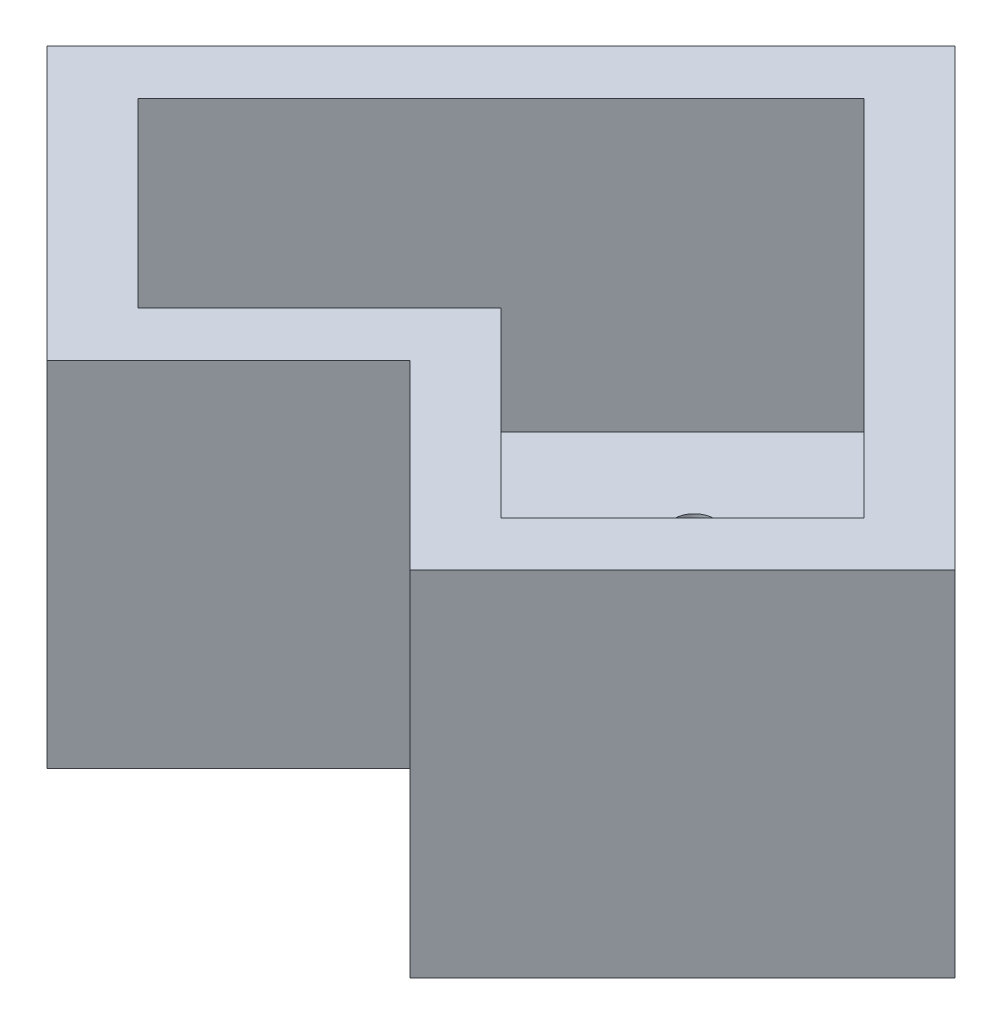
ISO-10303-21;
HEADER;
FILE_DESCRIPTION(('STEP AP214'),'2;1');
FILE_NAME('part.step','',(''),(''),'','','');
FILE_SCHEMA(('AUTOMOTIVE_DESIGN { 1 0 10303 214 1 1 1 1 }'));
ENDSEC;
DATA;
#1=APPLICATION_CONTEXT('core data for automotive mechanical design processes');
#2=APPLICATION_PROTOCOL_DEFINITION('international standard','automotive_design',2000,#1);
#3=PRODUCT_CONTEXT('',#1,'mechanical');
#4=PRODUCT('Part','Part','',(#3));
#5=PRODUCT_RELATED_PRODUCT_CATEGORY('part','',(#4));
#6=PRODUCT_DEFINITION_FORMATION('','',#4);
#7=PRODUCT_DEFINITION_CONTEXT('part definition',#1,'design');
#8=PRODUCT_DEFINITION('design','',#6,#7);
#9=PRODUCT_DEFINITION_SHAPE('','',#8);
#10=(LENGTH_UNIT() NAMED_UNIT(*) SI_UNIT(.MILLI.,.METRE.));
#11=(NAMED_UNIT(*) PLANE_ANGLE_UNIT() SI_UNIT($,.RADIAN.));
#12=(NAMED_UNIT(*) SI_UNIT($,.STERADIAN.) SOLID_ANGLE_UNIT());
#13=UNCERTAINTY_MEASURE_WITH_UNIT(LENGTH_MEASURE(1.E-05),#10,'distance_accuracy_value','');
#14=(GEOMETRIC_REPRESENTATION_CONTEXT(3) GLOBAL_UNCERTAINTY_ASSIGNED_CONTEXT((#13)) GLOBAL_UNIT_ASSIGNED_CONTEXT((#10,
#11,#12)) REPRESENTATION_CONTEXT('',''));
#15=CARTESIAN_POINT('',(0.,0.,0.));
#16=DIRECTION('',(0.,0.,1.));
#17=DIRECTION('',(1.,0.,0.));
#18=AXIS2_PLACEMENT_3D('',#15,#16,#17);
#19=CARTESIAN_POINT('',(0.,11.,0.));
#20=DIRECTION('',(0.,-1.,0.));
#21=DIRECTION('',(0.,0.,-1.));
#22=AXIS2_PLACEMENT_3D('',#19,#20,#21);
#23=PLANE('',#22);
#24=DIRECTION('',(0.707106781186548,0.,-0.707106781186547));
#25=VECTOR('',#24,1.);
#26=CARTESIAN_POINT('',(-5.65685424949238,11.,5.65685424949238));
#27=LINE('',#26,#25);
#28=CARTESIAN_POINT('',(-5.65685424949238,11.,5.65685424949238));
#29=VERTEX_POINT('',#28);
#30=CARTESIAN_POINT('',(0.,11.,0.));
#31=VERTEX_POINT('',#30);
#32=EDGE_CURVE('E147',#29,#31,#27,.T.);
#33=ORIENTED_EDGE('',*,*,#32,.T.);
#34=DIRECTION('',(0.707106781186548,0.,0.707106781186547));
#35=VECTOR('',#34,1.);
#36=CARTESIAN_POINT('',(0.,11.,0.));
#37=LINE('',#36,#35);
#38=CARTESIAN_POINT('',(5.65685424949238,11.,5.65685424949238));
#39=VERTEX_POINT('',#38);
#40=EDGE_CURVE('E98',#31,#39,#37,.T.);
#41=ORIENTED_EDGE('',*,*,#40,.T.);
#42=DIRECTION('',(0.707106781186548,0.,-0.707106781186547));
#43=VECTOR('',#42,1.);
#44=CARTESIAN_POINT('',(5.65685424949238,11.,5.65685424949238));
#45=LINE('',#44,#43);
#46=CARTESIAN_POINT('',(14.142135623731,11.,-2.82842712474619));
#47=VERTEX_POINT('',#46);
#48=EDGE_CURVE('E114',#39,#47,#45,.T.);
#49=ORIENTED_EDGE('',*,*,#48,.T.);
#50=DIRECTION('',(-0.707106781186548,0.,-0.707106781186547));
#51=VECTOR('',#50,1.);
#52=CARTESIAN_POINT('',(14.142135623731,11.,-2.82842712474619));
#53=LINE('',#52,#51);
#54=CARTESIAN_POINT('',(0.,11.,-16.9705627484771));
#55=VERTEX_POINT('',#54);
#56=EDGE_CURVE('E107',#47,#55,#53,.T.);
#57=ORIENTED_EDGE('',*,*,#56,.T.);
#58=DIRECTION('',(-0.707106781186548,0.,0.707106781186547));
#59=VECTOR('',#58,1.);
#60=CARTESIAN_POINT('',(0.,11.,-16.9705627484771));
#61=LINE('',#60,#59);
#62=CARTESIAN_POINT('',(-14.1421356237309,11.,-2.82842712474619));
#63=VERTEX_POINT('',#62);
#64=EDGE_CURVE('E111',#55,#63,#61,.T.);
#65=ORIENTED_EDGE('',*,*,#64,.T.);
#66=DIRECTION('',(0.707106781186548,0.,0.707106781186547));
#67=VECTOR('',#66,1.);
#68=CARTESIAN_POINT('',(-14.1421356237309,11.,-2.82842712474619));
#69=LINE('',#68,#67);
#70=EDGE_CURVE('E63',#63,#29,#69,.T.);
#71=ORIENTED_EDGE('',*,*,#70,.T.);
#72=EDGE_LOOP('',(#33,#41,#49,#57,#65,#71));
#73=FACE_BOUND('',#72,.T.);
#74=DIRECTION('',(0.707106781186548,0.,-0.707106781186547));
#75=VECTOR('',#74,1.);
#76=CARTESIAN_POINT('',(-1.4142135623731,11.,-1.4142135623731));
#77=LINE('',#76,#75);
#78=CARTESIAN_POINT('',(-5.65685424949238,11.,2.82842712474618));
#79=VERTEX_POINT('',#78);
#80=CARTESIAN_POINT('',(0.,11.,-2.82842712474619));
#81=VERTEX_POINT('',#80);
#82=EDGE_CURVE('E212',#79,#81,#77,.T.);
#83=ORIENTED_EDGE('',*,*,#82,.F.);
#84=DIRECTION('',(0.707106781186548,0.,0.707106781186547));
#85=VECTOR('',#84,1.);
#86=CARTESIAN_POINT('',(-4.24264068711928,11.,4.24264068711928));
#87=LINE('',#86,#85);
#88=CARTESIAN_POINT('',(-11.3137084989848,11.,-2.82842712474619));
#89=VERTEX_POINT('',#88);
#90=EDGE_CURVE('E191',#89,#79,#87,.T.);
#91=ORIENTED_EDGE('',*,*,#90,.F.);
#92=DIRECTION('',(-0.707106781186548,0.,0.707106781186547));
#93=VECTOR('',#92,1.);
#94=CARTESIAN_POINT('',(-7.07106781186547,11.,-7.07106781186548));
#95=LINE('',#94,#93);
#96=CARTESIAN_POINT('',(0.,11.,-14.1421356237309));
#97=VERTEX_POINT('',#96);
#98=EDGE_CURVE('E224',#97,#89,#95,.T.);
#99=ORIENTED_EDGE('',*,*,#98,.F.);
#100=DIRECTION('',(-0.707106781186548,0.,-0.707106781186547));
#101=VECTOR('',#100,1.);
#102=CARTESIAN_POINT('',(7.07106781186548,11.,-7.07106781186548));
#103=LINE('',#102,#101);
#104=CARTESIAN_POINT('',(11.3137084989848,11.,-2.82842712474619));
#105=VERTEX_POINT('',#104);
#106=EDGE_CURVE('E221',#105,#97,#103,.T.);
#107=ORIENTED_EDGE('',*,*,#106,.F.);
#108=DIRECTION('',(0.707106781186548,0.,-0.707106781186547));
#109=VECTOR('',#108,1.);
#110=CARTESIAN_POINT('',(4.24264068711928,11.,4.24264068711929));
#111=LINE('',#110,#109);
#112=CARTESIAN_POINT('',(5.65685424949238,11.,2.82842712474619));
#113=VERTEX_POINT('',#112);
#114=EDGE_CURVE('E218',#113,#105,#111,.T.);
#115=ORIENTED_EDGE('',*,*,#114,.F.);
#116=DIRECTION('',(0.707106781186548,0.,0.707106781186547));
#117=VECTOR('',#116,1.);
#118=CARTESIAN_POINT('',(1.41421356237309,11.,-1.4142135623731));
#119=LINE('',#118,#117);
#120=EDGE_CURVE('E215',#81,#113,#119,.T.);
#121=ORIENTED_EDGE('',*,*,#120,.F.);
#122=EDGE_LOOP('',(#83,#91,#99,#107,#115,#121));
#123=FACE_BOUND('',#122,.T.);
#124=ADVANCED_FACE('F37',(#73,#123),#23,.F.);
#125=CARTESIAN_POINT('',(-5.65685424949238,11.,5.65685424949238));
#126=DIRECTION('',(-0.707106781186547,0.,-0.707106781186548));
#127=DIRECTION('',(-0.707106781186548,0.,0.707106781186547));
#128=AXIS2_PLACEMENT_3D('',#125,#126,#127);
#129=PLANE('',#128);
#130=DIRECTION('',(0.707106781186548,0.,-0.707106781186547));
#131=VECTOR('',#130,1.);
#132=CARTESIAN_POINT('',(-5.65685424949238,0.,5.65685424949238));
#133=LINE('',#132,#131);
#134=CARTESIAN_POINT('',(-5.65685424949238,0.,5.65685424949238));
#135=VERTEX_POINT('',#134);
#136=CARTESIAN_POINT('',(0.,0.,0.));
#137=VERTEX_POINT('',#136);
#138=EDGE_CURVE('E135',#135,#137,#133,.T.);
#139=ORIENTED_EDGE('',*,*,#138,.T.);
#140=DIRECTION('',(0.,-1.,0.));
#141=VECTOR('',#140,1.);
#142=CARTESIAN_POINT('',(0.,11.,0.));
#143=LINE('',#142,#141);
#144=EDGE_CURVE('E11',#31,#137,#143,.T.);
#145=ORIENTED_EDGE('',*,*,#144,.F.);
#146=ORIENTED_EDGE('',*,*,#32,.F.);
#147=DIRECTION('',(0.,-1.,0.));
#148=VECTOR('',#147,1.);
#149=CARTESIAN_POINT('',(-5.65685424949238,11.,5.65685424949238));
#150=LINE('',#149,#148);
#151=EDGE_CURVE('E131',#29,#135,#150,.T.);
#152=ORIENTED_EDGE('',*,*,#151,.T.);
#153=EDGE_LOOP('',(#139,#145,#146,#152));
#154=FACE_BOUND('',#153,.T.);
#155=ADVANCED_FACE('F39',(#154),#129,.F.);
#156=CARTESIAN_POINT('',(0.,11.,0.));
#157=DIRECTION('',(0.707106781186547,0.,-0.707106781186548));
#158=DIRECTION('',(-0.707106781186548,0.,-0.707106781186547));
#159=AXIS2_PLACEMENT_3D('',#156,#157,#158);
#160=PLANE('',#159);
#161=DIRECTION('',(0.707106781186548,0.,0.707106781186547));
#162=VECTOR('',#161,1.);
#163=CARTESIAN_POINT('',(0.,0.,0.));
#164=LINE('',#163,#162);
#165=CARTESIAN_POINT('',(5.65685424949238,0.,5.65685424949238));
#166=VERTEX_POINT('',#165);
#167=EDGE_CURVE('E138',#137,#166,#164,.T.);
#168=ORIENTED_EDGE('',*,*,#167,.T.);
#169=DIRECTION('',(0.,-1.,0.));
#170=VECTOR('',#169,1.);
#171=CARTESIAN_POINT('',(5.65685424949238,11.,5.65685424949238));
#172=LINE('',#171,#170);
#173=EDGE_CURVE('E46',#39,#166,#172,.T.);
#174=ORIENTED_EDGE('',*,*,#173,.F.);
#175=ORIENTED_EDGE('',*,*,#40,.F.);
#176=ORIENTED_EDGE('',*,*,#144,.T.);
#177=EDGE_LOOP('',(#168,#174,#175,#176));
#178=FACE_BOUND('',#177,.T.);
#179=ADVANCED_FACE('F230',(#178),#160,.F.);
#180=CARTESIAN_POINT('',(5.65685424949238,11.,5.65685424949238));
#181=DIRECTION('',(-0.707106781186547,0.,-0.707106781186548));
#182=DIRECTION('',(-0.707106781186548,0.,0.707106781186547));
#183=AXIS2_PLACEMENT_3D('',#180,#181,#182);
#184=PLANE('',#183);
#185=DIRECTION('',(0.707106781186548,0.,-0.707106781186547));
#186=VECTOR('',#185,1.);
#187=CARTESIAN_POINT('',(5.65685424949238,0.,5.65685424949238));
#188=LINE('',#187,#186);
#189=CARTESIAN_POINT('',(14.142135623731,0.,-2.82842712474619));
#190=VERTEX_POINT('',#189);
#191=EDGE_CURVE('E141',#166,#190,#188,.T.);
#192=ORIENTED_EDGE('',*,*,#191,.T.);
#193=DIRECTION('',(0.,-1.,0.));
#194=VECTOR('',#193,1.);
#195=CARTESIAN_POINT('',(14.142135623731,11.,-2.82842712474619));
#196=LINE('',#195,#194);
#197=EDGE_CURVE('E126',#47,#190,#196,.T.);
#198=ORIENTED_EDGE('',*,*,#197,.F.);
#199=ORIENTED_EDGE('',*,*,#48,.F.);
#200=ORIENTED_EDGE('',*,*,#173,.T.);
#201=EDGE_LOOP('',(#192,#198,#199,#200));
#202=FACE_BOUND('',#201,.T.);
#203=ADVANCED_FACE('F233',(#202),#184,.F.);
#204=CARTESIAN_POINT('',(14.142135623731,11.,-2.82842712474619));
#205=DIRECTION('',(-0.707106781186547,0.,0.707106781186548));
#206=DIRECTION('',(0.707106781186548,0.,0.707106781186547));
#207=AXIS2_PLACEMENT_3D('',#204,#205,#206);
#208=PLANE('',#207);
#209=DIRECTION('',(-0.707106781186548,0.,-0.707106781186547));
#210=VECTOR('',#209,1.);
#211=CARTESIAN_POINT('',(14.142135623731,0.,-2.82842712474619));
#212=LINE('',#211,#210);
#213=CARTESIAN_POINT('',(0.,0.,-16.9705627484771));
#214=VERTEX_POINT('',#213);
#215=EDGE_CURVE('E123',#190,#214,#212,.T.);
#216=ORIENTED_EDGE('',*,*,#215,.T.);
#217=DIRECTION('',(0.,-1.,0.));
#218=VECTOR('',#217,1.);
#219=CARTESIAN_POINT('',(0.,11.,-16.9705627484771));
#220=LINE('',#219,#218);
#221=EDGE_CURVE('E120',#55,#214,#220,.T.);
#222=ORIENTED_EDGE('',*,*,#221,.F.);
#223=ORIENTED_EDGE('',*,*,#56,.F.);
#224=ORIENTED_EDGE('',*,*,#197,.T.);
#225=EDGE_LOOP('',(#216,#222,#223,#224));
#226=FACE_BOUND('',#225,.T.);
#227=ADVANCED_FACE('F121',(#226),#208,.F.);
#228=CARTESIAN_POINT('',(0.,11.,-16.9705627484771));
#229=DIRECTION('',(0.707106781186547,0.,0.707106781186548));
#230=DIRECTION('',(0.707106781186548,0.,-0.707106781186547));
#231=AXIS2_PLACEMENT_3D('',#228,#229,#230);
#232=PLANE('',#231);
#233=DIRECTION('',(-0.707106781186548,0.,0.707106781186547));
#234=VECTOR('',#233,1.);
#235=CARTESIAN_POINT('',(0.,0.,-16.9705627484771));
#236=LINE('',#235,#234);
#237=CARTESIAN_POINT('',(-14.1421356237309,0.,-2.82842712474619));
#238=VERTEX_POINT('',#237);
#239=EDGE_CURVE('E144',#214,#238,#236,.T.);
#240=ORIENTED_EDGE('',*,*,#239,.T.);
#241=DIRECTION('',(0.,-1.,0.));
#242=VECTOR('',#241,1.);
#243=CARTESIAN_POINT('',(-14.1421356237309,11.,-2.82842712474619));
#244=LINE('',#243,#242);
#245=EDGE_CURVE('E127',#63,#238,#244,.T.);
#246=ORIENTED_EDGE('',*,*,#245,.F.);
#247=ORIENTED_EDGE('',*,*,#64,.F.);
#248=ORIENTED_EDGE('',*,*,#221,.T.);
#249=EDGE_LOOP('',(#240,#246,#247,#248));
#250=FACE_BOUND('',#249,.T.);
#251=ADVANCED_FACE('F129',(#250),#232,.F.);
#252=CARTESIAN_POINT('',(-14.1421356237309,11.,-2.82842712474619));
#253=DIRECTION('',(0.707106781186547,0.,-0.707106781186548));
#254=DIRECTION('',(-0.707106781186548,0.,-0.707106781186547));
#255=AXIS2_PLACEMENT_3D('',#252,#253,#254);
#256=PLANE('',#255);
#257=DIRECTION('',(0.707106781186548,0.,0.707106781186547));
#258=VECTOR('',#257,1.);
#259=CARTESIAN_POINT('',(-14.1421356237309,0.,-2.82842712474619));
#260=LINE('',#259,#258);
#261=EDGE_CURVE('E90',#238,#135,#260,.T.);
#262=ORIENTED_EDGE('',*,*,#261,.T.);
#263=ORIENTED_EDGE('',*,*,#151,.F.);
#264=ORIENTED_EDGE('',*,*,#70,.F.);
#265=ORIENTED_EDGE('',*,*,#245,.T.);
#266=EDGE_LOOP('',(#262,#263,#264,#265));
#267=FACE_BOUND('',#266,.T.);
#268=ADVANCED_FACE('F237',(#267),#256,.F.);
#269=CARTESIAN_POINT('',(0.,0.,0.));
#270=DIRECTION('',(0.,-1.,0.));
#271=DIRECTION('',(0.,0.,-1.));
#272=AXIS2_PLACEMENT_3D('',#269,#270,#271);
#273=PLANE('',#272);
#274=CARTESIAN_POINT('',(5.65685424949238,0.,-1.55842712474619));
#275=DIRECTION('',(0.,-1.,0.));
#276=DIRECTION('',(0.,0.,-1.));
#277=AXIS2_PLACEMENT_3D('',#274,#275,#276);
#278=CIRCLE('',#277,0.625);
#279=CARTESIAN_POINT('',(5.65685424949238,0.,-2.18342712474619));
#280=VERTEX_POINT('',#279);
#281=EDGE_CURVE('E475',#280,#280,#278,.T.);
#282=ORIENTED_EDGE('',*,*,#281,.F.);
#283=EDGE_LOOP('',(#282));
#284=FACE_BOUND('',#283,.T.);
#285=CARTESIAN_POINT('',(0.,0.,-8.84842712474619));
#286=DIRECTION('',(0.,-1.,0.));
#287=DIRECTION('',(0.,0.,-1.));
#288=AXIS2_PLACEMENT_3D('',#285,#286,#287);
#289=CIRCLE('',#288,0.625);
#290=CARTESIAN_POINT('',(0.,0.,-9.47342712474619));
#291=VERTEX_POINT('',#290);
#292=EDGE_CURVE('E476',#291,#291,#289,.T.);
#293=ORIENTED_EDGE('',*,*,#292,.F.);
#294=EDGE_LOOP('',(#293));
#295=FACE_BOUND('',#294,.T.);
#296=CARTESIAN_POINT('',(0.,0.,-6.30842712474619));
#297=DIRECTION('',(0.,-1.,0.));
#298=DIRECTION('',(0.,0.,-1.));
#299=AXIS2_PLACEMENT_3D('',#296,#297,#298);
#300=CIRCLE('',#299,0.625);
#301=CARTESIAN_POINT('',(0.,0.,-6.93342712474619));
#302=VERTEX_POINT('',#301);
#303=EDGE_CURVE('E480',#302,#302,#300,.T.);
#304=ORIENTED_EDGE('',*,*,#303,.F.);
#305=EDGE_LOOP('',(#304));
#306=FACE_BOUND('',#305,.T.);
#307=CARTESIAN_POINT('',(-5.65685424949238,0.,-4.09842712474619));
#308=DIRECTION('',(0.,-1.,0.));
#309=DIRECTION('',(0.,0.,-1.));
#310=AXIS2_PLACEMENT_3D('',#307,#308,#309);
#311=CIRCLE('',#310,0.625);
#312=CARTESIAN_POINT('',(-5.65685424949238,0.,-4.72342712474619));
#313=VERTEX_POINT('',#312);
#314=EDGE_CURVE('E485',#313,#313,#311,.T.);
#315=ORIENTED_EDGE('',*,*,#314,.F.);
#316=EDGE_LOOP('',(#315));
#317=FACE_BOUND('',#316,.T.);
#318=CARTESIAN_POINT('',(5.65685424949238,0.,-4.09842712474619));
#319=DIRECTION('',(0.,-1.,0.));
#320=DIRECTION('',(0.,0.,-1.));
#321=AXIS2_PLACEMENT_3D('',#318,#319,#320);
#322=CIRCLE('',#321,0.625);
#323=CARTESIAN_POINT('',(5.65685424949238,0.,-4.72342712474619));
#324=VERTEX_POINT('',#323);
#325=EDGE_CURVE('E477',#324,#324,#322,.T.);
#326=ORIENTED_EDGE('',*,*,#325,.F.);
#327=EDGE_LOOP('',(#326));
#328=FACE_BOUND('',#327,.T.);
#329=CARTESIAN_POINT('',(-5.65685424949238,0.,-1.55842712474619));
#330=DIRECTION('',(0.,-1.,0.));
#331=DIRECTION('',(0.,0.,-1.));
#332=AXIS2_PLACEMENT_3D('',#329,#330,#331);
#333=CIRCLE('',#332,0.625);
#334=CARTESIAN_POINT('',(-5.65685424949238,0.,-2.18342712474619));
#335=VERTEX_POINT('',#334);
#336=EDGE_CURVE('E157',#335,#335,#333,.T.);
#337=ORIENTED_EDGE('',*,*,#336,.F.);
#338=EDGE_LOOP('',(#337));
#339=FACE_BOUND('',#338,.T.);
#340=ORIENTED_EDGE('',*,*,#138,.F.);
#341=ORIENTED_EDGE('',*,*,#261,.F.);
#342=ORIENTED_EDGE('',*,*,#239,.F.);
#343=ORIENTED_EDGE('',*,*,#215,.F.);
#344=ORIENTED_EDGE('',*,*,#191,.F.);
#345=ORIENTED_EDGE('',*,*,#167,.F.);
#346=EDGE_LOOP('',(#340,#341,#342,#343,#344,#345));
#347=FACE_BOUND('',#346,.T.);
#348=ADVANCED_FACE('F236',(#284,#295,#306,#317,#328,#339,#347),#273,.T.);
#349=CARTESIAN_POINT('',(-7.07106781186547,11.,4.24264068711928));
#350=DIRECTION('',(-0.707106781186547,0.,-0.707106781186548));
#351=DIRECTION('',(-0.707106781186548,0.,0.707106781186547));
#352=AXIS2_PLACEMENT_3D('',#349,#350,#351);
#353=PLANE('',#352);
#354=DIRECTION('',(0.707106781186548,0.,-0.707106781186547));
#355=VECTOR('',#354,1.);
#356=CARTESIAN_POINT('',(-1.4142135623731,2.,-1.4142135623731));
#357=LINE('',#356,#355);
#358=CARTESIAN_POINT('',(-5.65685424949238,2.,2.82842712474618));
#359=VERTEX_POINT('',#358);
#360=CARTESIAN_POINT('',(0.,2.,-2.82842712474619));
#361=VERTEX_POINT('',#360);
#362=EDGE_CURVE('E170',#359,#361,#357,.T.);
#363=ORIENTED_EDGE('',*,*,#362,.F.);
#364=DIRECTION('',(0.,-1.,0.));
#365=VECTOR('',#364,1.);
#366=CARTESIAN_POINT('',(-5.65685424949238,11.,2.82842712474619));
#367=LINE('',#366,#365);
#368=EDGE_CURVE('E189',#79,#359,#367,.T.);
#369=ORIENTED_EDGE('',*,*,#368,.F.);
#370=ORIENTED_EDGE('',*,*,#82,.T.);
#371=DIRECTION('',(0.,-1.,0.));
#372=VECTOR('',#371,1.);
#373=CARTESIAN_POINT('',(0.,11.,-2.82842712474619));
#374=LINE('',#373,#372);
#375=EDGE_CURVE('E139',#81,#361,#374,.T.);
#376=ORIENTED_EDGE('',*,*,#375,.T.);
#377=EDGE_LOOP('',(#363,#369,#370,#376));
#378=FACE_BOUND('',#377,.T.);
#379=ADVANCED_FACE('F253',(#378),#353,.T.);
#380=CARTESIAN_POINT('',(1.41421356237309,11.,-1.4142135623731));
#381=DIRECTION('',(0.707106781186547,0.,-0.707106781186548));
#382=DIRECTION('',(-0.707106781186548,0.,-0.707106781186547));
#383=AXIS2_PLACEMENT_3D('',#380,#381,#382);
#384=PLANE('',#383);
#385=DIRECTION('',(0.707106781186548,0.,0.707106781186547));
#386=VECTOR('',#385,1.);
#387=CARTESIAN_POINT('',(1.41421356237309,2.,-1.4142135623731));
#388=LINE('',#387,#386);
#389=CARTESIAN_POINT('',(5.65685424949238,2.,2.82842712474619));
#390=VERTEX_POINT('',#389);
#391=EDGE_CURVE('E174',#361,#390,#388,.T.);
#392=ORIENTED_EDGE('',*,*,#391,.F.);
#393=ORIENTED_EDGE('',*,*,#375,.F.);
#394=ORIENTED_EDGE('',*,*,#120,.T.);
#395=DIRECTION('',(0.,-1.,0.));
#396=VECTOR('',#395,1.);
#397=CARTESIAN_POINT('',(5.65685424949238,11.,2.82842712474619));
#398=LINE('',#397,#396);
#399=EDGE_CURVE('E188',#113,#390,#398,.T.);
#400=ORIENTED_EDGE('',*,*,#399,.T.);
#401=EDGE_LOOP('',(#392,#393,#394,#400));
#402=FACE_BOUND('',#401,.T.);
#403=ADVANCED_FACE('F294',(#402),#384,.T.);
#404=CARTESIAN_POINT('',(4.24264068711929,11.,4.24264068711928));
#405=DIRECTION('',(-0.707106781186547,0.,-0.707106781186548));
#406=DIRECTION('',(-0.707106781186548,0.,0.707106781186547));
#407=AXIS2_PLACEMENT_3D('',#404,#405,#406);
#408=PLANE('',#407);
#409=DIRECTION('',(0.707106781186548,0.,-0.707106781186547));
#410=VECTOR('',#409,1.);
#411=CARTESIAN_POINT('',(4.24264068711928,2.,4.24264068711929));
#412=LINE('',#411,#410);
#413=CARTESIAN_POINT('',(11.3137084989848,2.,-2.82842712474619));
#414=VERTEX_POINT('',#413);
#415=EDGE_CURVE('E181',#390,#414,#412,.T.);
#416=ORIENTED_EDGE('',*,*,#415,.F.);
#417=ORIENTED_EDGE('',*,*,#399,.F.);
#418=ORIENTED_EDGE('',*,*,#114,.T.);
#419=DIRECTION('',(0.,-1.,0.));
#420=VECTOR('',#419,1.);
#421=CARTESIAN_POINT('',(11.3137084989848,11.,-2.82842712474619));
#422=LINE('',#421,#420);
#423=EDGE_CURVE('E195',#105,#414,#422,.T.);
#424=ORIENTED_EDGE('',*,*,#423,.T.);
#425=EDGE_LOOP('',(#416,#417,#418,#424));
#426=FACE_BOUND('',#425,.T.);
#427=ADVANCED_FACE('F302',(#426),#408,.T.);
#428=CARTESIAN_POINT('',(12.7279220613579,11.,-1.4142135623731));
#429=DIRECTION('',(-0.707106781186547,0.,0.707106781186548));
#430=DIRECTION('',(0.707106781186548,0.,0.707106781186547));
#431=AXIS2_PLACEMENT_3D('',#428,#429,#430);
#432=PLANE('',#431);
#433=DIRECTION('',(-0.707106781186548,0.,-0.707106781186547));
#434=VECTOR('',#433,1.);
#435=CARTESIAN_POINT('',(7.07106781186548,2.,-7.07106781186548));
#436=LINE('',#435,#434);
#437=CARTESIAN_POINT('',(0.,2.,-14.1421356237309));
#438=VERTEX_POINT('',#437);
#439=EDGE_CURVE('E198',#414,#438,#436,.T.);
#440=ORIENTED_EDGE('',*,*,#439,.F.);
#441=ORIENTED_EDGE('',*,*,#423,.F.);
#442=ORIENTED_EDGE('',*,*,#106,.T.);
#443=DIRECTION('',(0.,-1.,0.));
#444=VECTOR('',#443,1.);
#445=CARTESIAN_POINT('',(0.,11.,-14.1421356237309));
#446=LINE('',#445,#444);
#447=EDGE_CURVE('E201',#97,#438,#446,.T.);
#448=ORIENTED_EDGE('',*,*,#447,.T.);
#449=EDGE_LOOP('',(#440,#441,#442,#448));
#450=FACE_BOUND('',#449,.T.);
#451=ADVANCED_FACE('F310',(#450),#432,.T.);
#452=CARTESIAN_POINT('',(1.41421356237309,11.,-15.556349186104));
#453=DIRECTION('',(0.707106781186547,0.,0.707106781186548));
#454=DIRECTION('',(0.707106781186548,0.,-0.707106781186547));
#455=AXIS2_PLACEMENT_3D('',#452,#453,#454);
#456=PLANE('',#455);
#457=DIRECTION('',(-0.707106781186548,0.,0.707106781186547));
#458=VECTOR('',#457,1.);
#459=CARTESIAN_POINT('',(-7.07106781186547,2.,-7.07106781186548));
#460=LINE('',#459,#458);
#461=CARTESIAN_POINT('',(-11.3137084989848,2.,-2.82842712474619));
#462=VERTEX_POINT('',#461);
#463=EDGE_CURVE('E204',#438,#462,#460,.T.);
#464=ORIENTED_EDGE('',*,*,#463,.F.);
#465=ORIENTED_EDGE('',*,*,#447,.F.);
#466=ORIENTED_EDGE('',*,*,#98,.T.);
#467=DIRECTION('',(0.,-1.,0.));
#468=VECTOR('',#467,1.);
#469=CARTESIAN_POINT('',(-11.3137084989848,11.,-2.82842712474619));
#470=LINE('',#469,#468);
#471=EDGE_CURVE('E54',#89,#462,#470,.T.);
#472=ORIENTED_EDGE('',*,*,#471,.T.);
#473=EDGE_LOOP('',(#464,#465,#466,#472));
#474=FACE_BOUND('',#473,.T.);
#475=ADVANCED_FACE('F318',(#474),#456,.T.);
#476=CARTESIAN_POINT('',(-12.7279220613579,11.,-4.24264068711929));
#477=DIRECTION('',(0.707106781186547,0.,-0.707106781186548));
#478=DIRECTION('',(-0.707106781186548,0.,-0.707106781186547));
#479=AXIS2_PLACEMENT_3D('',#476,#477,#478);
#480=PLANE('',#479);
#481=DIRECTION('',(0.707106781186548,0.,0.707106781186547));
#482=VECTOR('',#481,1.);
#483=CARTESIAN_POINT('',(-4.24264068711928,2.,4.24264068711928));
#484=LINE('',#483,#482);
#485=EDGE_CURVE('E209',#462,#359,#484,.T.);
#486=ORIENTED_EDGE('',*,*,#485,.F.);
#487=ORIENTED_EDGE('',*,*,#471,.F.);
#488=ORIENTED_EDGE('',*,*,#90,.T.);
#489=ORIENTED_EDGE('',*,*,#368,.T.);
#490=EDGE_LOOP('',(#486,#487,#488,#489));
#491=FACE_BOUND('',#490,.T.);
#492=ADVANCED_FACE('F326',(#491),#480,.T.);
#493=CARTESIAN_POINT('',(0.,2.,0.));
#494=DIRECTION('',(0.,-1.,0.));
#495=DIRECTION('',(0.,0.,-1.));
#496=AXIS2_PLACEMENT_3D('',#493,#494,#495);
#497=PLANE('',#496);
#498=CARTESIAN_POINT('',(5.65685424949238,2.,-1.55842712474619));
#499=DIRECTION('',(0.,-1.,0.));
#500=DIRECTION('',(0.,0.,-1.));
#501=AXIS2_PLACEMENT_3D('',#498,#499,#500);
#502=CIRCLE('',#501,0.625);
#503=CARTESIAN_POINT('',(5.65685424949238,2.,-2.18342712474619));
#504=VERTEX_POINT('',#503);
#505=EDGE_CURVE('E41',#504,#504,#502,.T.);
#506=ORIENTED_EDGE('',*,*,#505,.T.);
#507=EDGE_LOOP('',(#506));
#508=FACE_BOUND('',#507,.T.);
#509=CARTESIAN_POINT('',(0.,2.,-8.84842712474619));
#510=DIRECTION('',(0.,-1.,0.));
#511=DIRECTION('',(0.,0.,-1.));
#512=AXIS2_PLACEMENT_3D('',#509,#510,#511);
#513=CIRCLE('',#512,0.625);
#514=CARTESIAN_POINT('',(0.,2.,-9.47342712474619));
#515=VERTEX_POINT('',#514);
#516=EDGE_CURVE('E165',#515,#515,#513,.T.);
#517=ORIENTED_EDGE('',*,*,#516,.T.);
#518=EDGE_LOOP('',(#517));
#519=FACE_BOUND('',#518,.T.);
#520=CARTESIAN_POINT('',(0.,2.,-6.30842712474619));
#521=DIRECTION('',(0.,-1.,0.));
#522=DIRECTION('',(0.,0.,-1.));
#523=AXIS2_PLACEMENT_3D('',#520,#521,#522);
#524=CIRCLE('',#523,0.625);
#525=CARTESIAN_POINT('',(0.,2.,-6.93342712474619));
#526=VERTEX_POINT('',#525);
#527=EDGE_CURVE('E163',#526,#526,#524,.T.);
#528=ORIENTED_EDGE('',*,*,#527,.T.);
#529=EDGE_LOOP('',(#528));
#530=FACE_BOUND('',#529,.T.);
#531=CARTESIAN_POINT('',(-5.65685424949238,2.,-4.09842712474619));
#532=DIRECTION('',(0.,-1.,0.));
#533=DIRECTION('',(0.,0.,-1.));
#534=AXIS2_PLACEMENT_3D('',#531,#532,#533);
#535=CIRCLE('',#534,0.625);
#536=CARTESIAN_POINT('',(-5.65685424949238,2.,-4.72342712474619));
#537=VERTEX_POINT('',#536);
#538=EDGE_CURVE('E160',#537,#537,#535,.T.);
#539=ORIENTED_EDGE('',*,*,#538,.T.);
#540=EDGE_LOOP('',(#539));
#541=FACE_BOUND('',#540,.T.);
#542=CARTESIAN_POINT('',(5.65685424949238,2.,-4.09842712474619));
#543=DIRECTION('',(0.,-1.,0.));
#544=DIRECTION('',(0.,0.,-1.));
#545=AXIS2_PLACEMENT_3D('',#542,#543,#544);
#546=CIRCLE('',#545,0.625);
#547=CARTESIAN_POINT('',(5.65685424949238,2.,-4.72342712474619));
#548=VERTEX_POINT('',#547);
#549=EDGE_CURVE('E156',#548,#548,#546,.T.);
#550=ORIENTED_EDGE('',*,*,#549,.T.);
#551=EDGE_LOOP('',(#550));
#552=FACE_BOUND('',#551,.T.);
#553=CARTESIAN_POINT('',(-5.65685424949238,2.,-1.55842712474619));
#554=DIRECTION('',(0.,-1.,0.));
#555=DIRECTION('',(0.,0.,-1.));
#556=AXIS2_PLACEMENT_3D('',#553,#554,#555);
#557=CIRCLE('',#556,0.625);
#558=CARTESIAN_POINT('',(-5.65685424949238,2.,-2.18342712474619));
#559=VERTEX_POINT('',#558);
#560=EDGE_CURVE('E153',#559,#559,#557,.T.);
#561=ORIENTED_EDGE('',*,*,#560,.T.);
#562=EDGE_LOOP('',(#561));
#563=FACE_BOUND('',#562,.T.);
#564=ORIENTED_EDGE('',*,*,#362,.T.);
#565=ORIENTED_EDGE('',*,*,#391,.T.);
#566=ORIENTED_EDGE('',*,*,#415,.T.);
#567=ORIENTED_EDGE('',*,*,#439,.T.);
#568=ORIENTED_EDGE('',*,*,#463,.T.);
#569=ORIENTED_EDGE('',*,*,#485,.T.);
#570=EDGE_LOOP('',(#564,#565,#566,#567,#568,#569));
#571=FACE_BOUND('',#570,.T.);
#572=ADVANCED_FACE('F249',(#508,#519,#530,#541,#552,#563,#571),#497,.F.);
#573=CARTESIAN_POINT('',(-5.65685424949238,10.,-1.55842712474619));
#574=DIRECTION('',(0.,-1.,0.));
#575=DIRECTION('',(0.,0.,-1.));
#576=AXIS2_PLACEMENT_3D('',#573,#574,#575);
#577=CYLINDRICAL_SURFACE('',#576,0.625);
#578=ORIENTED_EDGE('',*,*,#336,.T.);
#579=EDGE_LOOP('',(#578));
#580=FACE_BOUND('',#579,.T.);
#581=ORIENTED_EDGE('',*,*,#560,.F.);
#582=EDGE_LOOP('',(#581));
#583=FACE_BOUND('',#582,.T.);
#584=ADVANCED_FACE('F338',(#580,#583),#577,.F.);
#585=CARTESIAN_POINT('',(5.65685424949238,10.,-4.09842712474619));
#586=DIRECTION('',(0.,-1.,0.));
#587=DIRECTION('',(0.,0.,-1.));
#588=AXIS2_PLACEMENT_3D('',#585,#586,#587);
#589=CYLINDRICAL_SURFACE('',#588,0.625);
#590=ORIENTED_EDGE('',*,*,#325,.T.);
#591=EDGE_LOOP('',(#590));
#592=FACE_BOUND('',#591,.T.);
#593=ORIENTED_EDGE('',*,*,#549,.F.);
#594=EDGE_LOOP('',(#593));
#595=FACE_BOUND('',#594,.T.);
#596=ADVANCED_FACE('F347',(#592,#595),#589,.F.);
#597=CARTESIAN_POINT('',(-5.65685424949238,10.,-4.09842712474619));
#598=DIRECTION('',(0.,-1.,0.));
#599=DIRECTION('',(0.,0.,-1.));
#600=AXIS2_PLACEMENT_3D('',#597,#598,#599);
#601=CYLINDRICAL_SURFACE('',#600,0.625);
#602=ORIENTED_EDGE('',*,*,#314,.T.);
#603=EDGE_LOOP('',(#602));
#604=FACE_BOUND('',#603,.T.);
#605=ORIENTED_EDGE('',*,*,#538,.F.);
#606=EDGE_LOOP('',(#605));
#607=FACE_BOUND('',#606,.T.);
#608=ADVANCED_FACE('F354',(#604,#607),#601,.F.);
#609=CARTESIAN_POINT('',(0.,10.,-6.30842712474619));
#610=DIRECTION('',(0.,-1.,0.));
#611=DIRECTION('',(0.,0.,-1.));
#612=AXIS2_PLACEMENT_3D('',#609,#610,#611);
#613=CYLINDRICAL_SURFACE('',#612,0.625);
#614=ORIENTED_EDGE('',*,*,#303,.T.);
#615=EDGE_LOOP('',(#614));
#616=FACE_BOUND('',#615,.T.);
#617=ORIENTED_EDGE('',*,*,#527,.F.);
#618=EDGE_LOOP('',(#617));
#619=FACE_BOUND('',#618,.T.);
#620=ADVANCED_FACE('F362',(#616,#619),#613,.F.);
#621=CARTESIAN_POINT('',(0.,10.,-8.84842712474619));
#622=DIRECTION('',(0.,-1.,0.));
#623=DIRECTION('',(0.,0.,-1.));
#624=AXIS2_PLACEMENT_3D('',#621,#622,#623);
#625=CYLINDRICAL_SURFACE('',#624,0.625);
#626=ORIENTED_EDGE('',*,*,#292,.T.);
#627=EDGE_LOOP('',(#626));
#628=FACE_BOUND('',#627,.T.);
#629=ORIENTED_EDGE('',*,*,#516,.F.);
#630=EDGE_LOOP('',(#629));
#631=FACE_BOUND('',#630,.T.);
#632=ADVANCED_FACE('F370',(#628,#631),#625,.F.);
#633=CARTESIAN_POINT('',(5.65685424949238,10.,-1.55842712474619));
#634=DIRECTION('',(0.,-1.,0.));
#635=DIRECTION('',(0.,0.,-1.));
#636=AXIS2_PLACEMENT_3D('',#633,#634,#635);
#637=CYLINDRICAL_SURFACE('',#636,0.625);
#638=ORIENTED_EDGE('',*,*,#281,.T.);
#639=EDGE_LOOP('',(#638));
#640=FACE_BOUND('',#639,.T.);
#641=ORIENTED_EDGE('',*,*,#505,.F.);
#642=EDGE_LOOP('',(#641));
#643=FACE_BOUND('',#642,.T.);
#644=ADVANCED_FACE('F378',(#640,#643),#637,.F.);
#645=CLOSED_SHELL('',(#124,#155,#179,#203,#227,#251,#268,#348,#379,#403,#427,#451,#475,#492,
#572,#584,#596,#608,#620,#632,#644));
#646=MANIFOLD_SOLID_BREP('B2',#645);
#647=ADVANCED_BREP_SHAPE_REPRESENTATION('',(#18,#646),#14);
#648=SHAPE_DEFINITION_REPRESENTATION(#9,#647);
ENDSEC;
END-ISO-10303-21;
